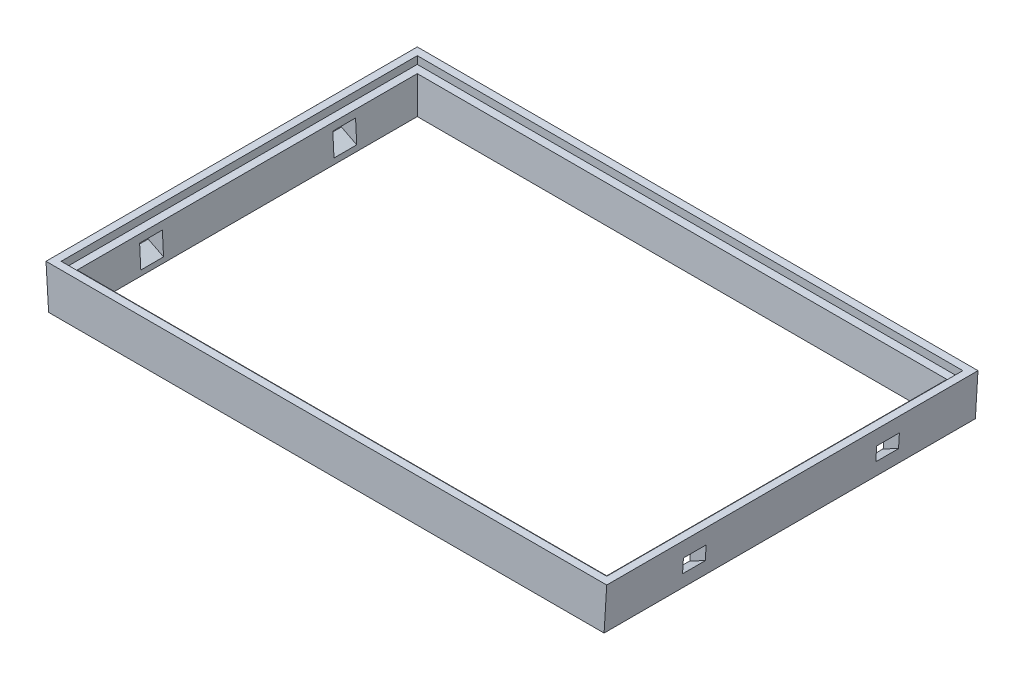
ISO-10303-21;
HEADER;
FILE_DESCRIPTION(('STEP AP214'),'2;1');
FILE_NAME('part.step','',(''),(''),'','','');
FILE_SCHEMA(('AUTOMOTIVE_DESIGN { 1 0 10303 214 1 1 1 1 }'));
ENDSEC;
DATA;
#1=APPLICATION_CONTEXT('core data for automotive mechanical design processes');
#2=APPLICATION_PROTOCOL_DEFINITION('international standard','automotive_design',2000,#1);
#3=PRODUCT_CONTEXT('',#1,'mechanical');
#4=PRODUCT('Part','Part','',(#3));
#5=PRODUCT_RELATED_PRODUCT_CATEGORY('part','',(#4));
#6=PRODUCT_DEFINITION_FORMATION('','',#4);
#7=PRODUCT_DEFINITION_CONTEXT('part definition',#1,'design');
#8=PRODUCT_DEFINITION('design','',#6,#7);
#9=PRODUCT_DEFINITION_SHAPE('','',#8);
#10=(LENGTH_UNIT() NAMED_UNIT(*) SI_UNIT(.MILLI.,.METRE.));
#11=(NAMED_UNIT(*) PLANE_ANGLE_UNIT() SI_UNIT($,.RADIAN.));
#12=(NAMED_UNIT(*) SI_UNIT($,.STERADIAN.) SOLID_ANGLE_UNIT());
#13=UNCERTAINTY_MEASURE_WITH_UNIT(LENGTH_MEASURE(1.E-05),#10,'distance_accuracy_value','');
#14=(GEOMETRIC_REPRESENTATION_CONTEXT(3) GLOBAL_UNCERTAINTY_ASSIGNED_CONTEXT((#13)) GLOBAL_UNIT_ASSIGNED_CONTEXT((#10,
#11,#12)) REPRESENTATION_CONTEXT('',''));
#15=CARTESIAN_POINT('',(0.,0.,0.));
#16=DIRECTION('',(0.,0.,1.));
#17=DIRECTION('',(1.,0.,0.));
#18=AXIS2_PLACEMENT_3D('',#15,#16,#17);
#19=CARTESIAN_POINT('',(87.2159938434906,-31.5566148727257,49.));
#20=DIRECTION('',(-0.998134798421867,0.0610485395348529,0.));
#21=DIRECTION('',(-0.0610485395348529,-0.998134798421867,0.));
#22=AXIS2_PLACEMENT_3D('',#19,#20,#21);
#23=PLANE('',#22);
#24=DIRECTION('',(0.,0.,1.));
#25=VECTOR('',#24,1.);
#26=CARTESIAN_POINT('',(90.4768218310422,21.7574514561684,7.93504103845607));
#27=LINE('',#26,#25);
#28=CARTESIAN_POINT('',(90.4768218310422,21.7574514561684,10.25));
#29=VERTEX_POINT('',#28);
#30=CARTESIAN_POINT('',(90.4768218310422,21.7574514561684,13.25));
#31=VERTEX_POINT('',#30);
#32=EDGE_CURVE('E360',#29,#31,#27,.T.);
#33=ORIENTED_EDGE('',*,*,#32,.T.);
#34=DIRECTION('',(-0.0610485395348529,-0.998134798421867,0.));
#35=VECTOR('',#34,1.);
#36=CARTESIAN_POINT('',(87.2159938434906,-31.5566148727257,13.25));
#37=LINE('',#36,#35);
#38=CARTESIAN_POINT('',(90.5907806278932,23.6206613149119,13.25));
#39=VERTEX_POINT('',#38);
#40=EDGE_CURVE('E429',#39,#31,#37,.T.);
#41=ORIENTED_EDGE('',*,*,#40,.F.);
#42=DIRECTION('',(0.,0.,1.));
#43=VECTOR('',#42,1.);
#44=CARTESIAN_POINT('',(90.5907806278932,23.6206613149119,49.));
#45=LINE('',#44,#43);
#46=CARTESIAN_POINT('',(90.5907806278932,23.6206613149119,10.25));
#47=VERTEX_POINT('',#46);
#48=EDGE_CURVE('E401',#47,#39,#45,.T.);
#49=ORIENTED_EDGE('',*,*,#48,.F.);
#50=DIRECTION('',(0.0610485395348529,0.998134798421867,0.));
#51=VECTOR('',#50,1.);
#52=CARTESIAN_POINT('',(87.2159938434906,-31.5566148727257,10.25));
#53=LINE('',#52,#51);
#54=EDGE_CURVE('E426',#29,#47,#53,.T.);
#55=ORIENTED_EDGE('',*,*,#54,.F.);
#56=EDGE_LOOP('',(#33,#41,#49,#55));
#57=FACE_BOUND('',#56,.T.);
#58=DIRECTION('',(0.0610485395348529,0.998134798421867,0.));
#59=VECTOR('',#58,1.);
#60=CARTESIAN_POINT('',(87.2159938434906,-31.5566148727257,35.75));
#61=LINE('',#60,#59);
#62=CARTESIAN_POINT('',(90.4734421965386,21.7021949204721,35.75));
#63=VERTEX_POINT('',#62);
#64=CARTESIAN_POINT('',(90.587418021541,23.5656831870309,35.75));
#65=VERTEX_POINT('',#64);
#66=EDGE_CURVE('E438',#63,#65,#61,.T.);
#67=ORIENTED_EDGE('',*,*,#66,.F.);
#68=DIRECTION('',(0.,0.,-1.));
#69=VECTOR('',#68,1.);
#70=CARTESIAN_POINT('',(90.4734421965386,21.7021949204721,41.0643892649192));
#71=LINE('',#70,#69);
#72=CARTESIAN_POINT('',(90.4734421965386,21.7021949204721,38.75));
#73=VERTEX_POINT('',#72);
#74=EDGE_CURVE('E375',#73,#63,#71,.T.);
#75=ORIENTED_EDGE('',*,*,#74,.F.);
#76=DIRECTION('',(-0.0610485395348529,-0.998134798421867,0.));
#77=VECTOR('',#76,1.);
#78=CARTESIAN_POINT('',(87.2159938434906,-31.5566148727257,38.75));
#79=LINE('',#78,#77);
#80=CARTESIAN_POINT('',(90.587418021541,23.565683187031,38.75));
#81=VERTEX_POINT('',#80);
#82=EDGE_CURVE('E432',#81,#73,#79,.T.);
#83=ORIENTED_EDGE('',*,*,#82,.F.);
#84=DIRECTION('',(0.,0.,1.));
#85=VECTOR('',#84,1.);
#86=CARTESIAN_POINT('',(90.587418021541,23.5656831870309,49.));
#87=LINE('',#86,#85);
#88=EDGE_CURVE('E435',#65,#81,#87,.T.);
#89=ORIENTED_EDGE('',*,*,#88,.F.);
#90=EDGE_LOOP('',(#67,#75,#83,#89));
#91=FACE_BOUND('',#90,.T.);
#92=DIRECTION('',(0.0610485395348529,0.998134798421867,0.));
#93=VECTOR('',#92,1.);
#94=CARTESIAN_POINT('',(87.2159938434906,-31.5566148727257,49.));
#95=LINE('',#94,#93);
#96=CARTESIAN_POINT('',(90.3693314951957,20.,49.));
#97=VERTEX_POINT('',#96);
#98=CARTESIAN_POINT('',(90.7159938434905,25.6678792936265,49.));
#99=VERTEX_POINT('',#98);
#100=EDGE_CURVE('E291',#97,#99,#95,.T.);
#101=ORIENTED_EDGE('',*,*,#100,.F.);
#102=DIRECTION('',(0.,0.,-1.));
#103=VECTOR('',#102,1.);
#104=CARTESIAN_POINT('',(90.3693314951957,20.,49.));
#105=LINE('',#104,#103);
#106=CARTESIAN_POINT('',(90.3693314951957,20.,0.));
#107=VERTEX_POINT('',#106);
#108=EDGE_CURVE('E350',#97,#107,#105,.T.);
#109=ORIENTED_EDGE('',*,*,#108,.T.);
#110=DIRECTION('',(0.0610485395348529,0.998134798421867,0.));
#111=VECTOR('',#110,1.);
#112=CARTESIAN_POINT('',(87.2159938434906,-31.5566148727257,0.));
#113=LINE('',#112,#111);
#114=CARTESIAN_POINT('',(90.7159938434905,25.6678792936265,0.));
#115=VERTEX_POINT('',#114);
#116=EDGE_CURVE('E287',#107,#115,#113,.T.);
#117=ORIENTED_EDGE('',*,*,#116,.T.);
#118=DIRECTION('',(0.,0.,-1.));
#119=VECTOR('',#118,1.);
#120=CARTESIAN_POINT('',(90.7159938434905,25.6678792936265,49.));
#121=LINE('',#120,#119);
#122=EDGE_CURVE('E294',#99,#115,#121,.T.);
#123=ORIENTED_EDGE('',*,*,#122,.F.);
#124=EDGE_LOOP('',(#101,#109,#117,#123));
#125=FACE_BOUND('',#124,.T.);
#126=ADVANCED_FACE('F69',(#57,#91,#125),#23,.F.);
#127=CARTESIAN_POINT('',(88.7159938434905,25.6678792936265,0.));
#128=DIRECTION('',(0.998629534754574,-0.0523359562429438,0.));
#129=DIRECTION('',(0.0523359562429438,0.998629534754574,0.));
#130=AXIS2_PLACEMENT_3D('',#127,#128,#129);
#131=PLANE('',#130);
#132=DIRECTION('',(-0.0523359562429442,-0.998629534754574,0.));
#133=VECTOR('',#132,1.);
#134=CARTESIAN_POINT('',(88.6141327079296,23.7242530428216,13.25));
#135=LINE('',#134,#133);
#136=CARTESIAN_POINT('',(88.6141327079296,23.7242530428216,13.25));
#137=VERTEX_POINT('',#136);
#138=CARTESIAN_POINT('',(88.4571248392008,20.7283644385579,13.25));
#139=VERTEX_POINT('',#138);
#140=EDGE_CURVE('E379',#137,#139,#135,.T.);
#141=ORIENTED_EDGE('',*,*,#140,.T.);
#142=DIRECTION('',(0.,0.,-1.));
#143=VECTOR('',#142,1.);
#144=CARTESIAN_POINT('',(88.4571248392008,20.7283644385579,13.25));
#145=LINE('',#144,#143);
#146=CARTESIAN_POINT('',(88.4571248392008,20.7283644385579,10.25));
#147=VERTEX_POINT('',#146);
#148=EDGE_CURVE('E415',#139,#147,#145,.T.);
#149=ORIENTED_EDGE('',*,*,#148,.T.);
#150=DIRECTION('',(0.0523359562429442,0.998629534754574,0.));
#151=VECTOR('',#150,1.);
#152=CARTESIAN_POINT('',(88.6141327079296,23.7242530428216,10.25));
#153=LINE('',#152,#151);
#154=CARTESIAN_POINT('',(88.6141327079296,23.7242530428216,10.25));
#155=VERTEX_POINT('',#154);
#156=EDGE_CURVE('E411',#147,#155,#153,.T.);
#157=ORIENTED_EDGE('',*,*,#156,.T.);
#158=DIRECTION('',(0.,0.,1.));
#159=VECTOR('',#158,1.);
#160=CARTESIAN_POINT('',(88.6141327079296,23.7242530428216,13.25));
#161=LINE('',#160,#159);
#162=EDGE_CURVE('E407',#155,#137,#161,.T.);
#163=ORIENTED_EDGE('',*,*,#162,.T.);
#164=EDGE_LOOP('',(#141,#149,#157,#163));
#165=FACE_BOUND('',#164,.T.);
#166=DIRECTION('',(0.0522644276887139,0.997264688634237,-0.052264427688714));
#167=VECTOR('',#166,1.);
#168=CARTESIAN_POINT('',(88.7214569842938,25.7721222300377,1.99453685919674));
#169=LINE('',#168,#167);
#170=CARTESIAN_POINT('',(88.4189528764672,20.,2.2970409670233));
#171=VERTEX_POINT('',#170);
#172=CARTESIAN_POINT('',(88.6635860642075,24.6678792936265,2.05240777928304));
#173=VERTEX_POINT('',#172);
#174=EDGE_CURVE('E273',#171,#173,#169,.T.);
#175=ORIENTED_EDGE('',*,*,#174,.F.);
#176=DIRECTION('',(0.,0.,1.));
#177=VECTOR('',#176,1.);
#178=CARTESIAN_POINT('',(88.4189528764672,20.,0.));
#179=LINE('',#178,#177);
#180=CARTESIAN_POINT('',(88.4189528764672,20.,46.7029590329767));
#181=VERTEX_POINT('',#180);
#182=EDGE_CURVE('E93',#171,#181,#179,.T.);
#183=ORIENTED_EDGE('',*,*,#182,.T.);
#184=DIRECTION('',(0.0522644276887139,0.997264688634237,0.052264427688714));
#185=VECTOR('',#184,1.);
#186=CARTESIAN_POINT('',(88.4736598605566,21.0438714411819,46.757666017066));
#187=LINE('',#186,#185);
#188=CARTESIAN_POINT('',(88.6635860642075,24.6678792936265,46.947592220717));
#189=VERTEX_POINT('',#188);
#190=EDGE_CURVE('E277',#181,#189,#187,.T.);
#191=ORIENTED_EDGE('',*,*,#190,.T.);
#192=DIRECTION('',(0.,0.,1.));
#193=VECTOR('',#192,1.);
#194=CARTESIAN_POINT('',(88.6635860642075,24.6678792936265,0.));
#195=LINE('',#194,#193);
#196=EDGE_CURVE('E78',#173,#189,#195,.T.);
#197=ORIENTED_EDGE('',*,*,#196,.F.);
#198=EDGE_LOOP('',(#175,#183,#191,#197));
#199=FACE_BOUND('',#198,.T.);
#200=DIRECTION('',(0.0523359562429442,0.998629534754574,0.));
#201=VECTOR('',#200,1.);
#202=CARTESIAN_POINT('',(88.6112501079645,23.6692497588719,35.75));
#203=LINE('',#202,#201);
#204=CARTESIAN_POINT('',(88.4542422392357,20.6733611546082,35.75));
#205=VERTEX_POINT('',#204);
#206=CARTESIAN_POINT('',(88.6112501079645,23.6692497588719,35.75));
#207=VERTEX_POINT('',#206);
#208=EDGE_CURVE('E380',#205,#207,#203,.T.);
#209=ORIENTED_EDGE('',*,*,#208,.T.);
#210=DIRECTION('',(0.,0.,1.));
#211=VECTOR('',#210,1.);
#212=CARTESIAN_POINT('',(88.6112501079645,23.6692497588719,35.75));
#213=LINE('',#212,#211);
#214=CARTESIAN_POINT('',(88.6112501079645,23.6692497588719,38.75));
#215=VERTEX_POINT('',#214);
#216=EDGE_CURVE('E393',#207,#215,#213,.T.);
#217=ORIENTED_EDGE('',*,*,#216,.T.);
#218=DIRECTION('',(-0.0523359562429442,-0.998629534754574,0.));
#219=VECTOR('',#218,1.);
#220=CARTESIAN_POINT('',(88.6112501079645,23.6692497588719,38.75));
#221=LINE('',#220,#219);
#222=CARTESIAN_POINT('',(88.4542422392357,20.6733611546082,38.75));
#223=VERTEX_POINT('',#222);
#224=EDGE_CURVE('E389',#215,#223,#221,.T.);
#225=ORIENTED_EDGE('',*,*,#224,.T.);
#226=DIRECTION('',(0.,0.,-1.));
#227=VECTOR('',#226,1.);
#228=CARTESIAN_POINT('',(88.4542422392357,20.6733611546082,35.75));
#229=LINE('',#228,#227);
#230=EDGE_CURVE('E384',#223,#205,#229,.T.);
#231=ORIENTED_EDGE('',*,*,#230,.T.);
#232=EDGE_LOOP('',(#209,#217,#225,#231));
#233=FACE_BOUND('',#232,.T.);
#234=ADVANCED_FACE('F338',(#165,#199,#233),#131,.F.);
#235=CARTESIAN_POINT('',(16.8205959095423,23.6195811303357,13.25));
#236=DIRECTION('',(0.,0.,1.));
#237=DIRECTION('',(1.,0.,0.));
#238=AXIS2_PLACEMENT_3D('',#235,#236,#237);
#239=PLANE('',#238);
#240=DIRECTION('',(0.891006524188368,-0.453990499739547,0.));
#241=VECTOR('',#240,1.);
#242=CARTESIAN_POINT('',(18.9748628477803,20.7283644385579,13.25));
#243=LINE('',#242,#241);
#244=CARTESIAN_POINT('',(16.9551658559388,21.7574514561684,13.25));
#245=VERTEX_POINT('',#244);
#246=CARTESIAN_POINT('',(18.9748628477803,20.7283644385579,13.25));
#247=VERTEX_POINT('',#246);
#248=EDGE_CURVE('E442',#245,#247,#243,.T.);
#249=ORIENTED_EDGE('',*,*,#248,.F.);
#250=DIRECTION('',(0.0610485395348535,-0.998134798421867,0.));
#251=VECTOR('',#250,1.);
#252=CARTESIAN_POINT('',(16.7159938434905,25.6678792936265,13.25));
#253=LINE('',#252,#251);
#254=CARTESIAN_POINT('',(16.8412070590879,23.6206613149119,13.25));
#255=VERTEX_POINT('',#254);
#256=EDGE_CURVE('E511',#255,#245,#253,.T.);
#257=ORIENTED_EDGE('',*,*,#256,.F.);
#258=DIRECTION('',(0.998629534754574,0.052335956242944,0.));
#259=VECTOR('',#258,1.);
#260=CARTESIAN_POINT('',(16.8205959095423,23.6195811303357,13.25));
#261=LINE('',#260,#259);
#262=CARTESIAN_POINT('',(18.8178549790515,23.7242530428216,13.25));
#263=VERTEX_POINT('',#262);
#264=EDGE_CURVE('E460',#255,#263,#261,.T.);
#265=ORIENTED_EDGE('',*,*,#264,.T.);
#266=DIRECTION('',(0.0523359562429442,-0.998629534754574,0.));
#267=VECTOR('',#266,1.);
#268=CARTESIAN_POINT('',(18.8178549790515,23.7242530428216,13.25));
#269=LINE('',#268,#267);
#270=EDGE_CURVE('E467',#263,#247,#269,.T.);
#271=ORIENTED_EDGE('',*,*,#270,.T.);
#272=EDGE_LOOP('',(#249,#257,#265,#271));
#273=FACE_BOUND('',#272,.T.);
#274=ADVANCED_FACE('F598',(#273),#239,.F.);
#275=CARTESIAN_POINT('',(16.8205959095423,23.6195811303357,10.25));
#276=DIRECTION('',(0.,0.,-1.));
#277=DIRECTION('',(0.,1.,0.));
#278=AXIS2_PLACEMENT_3D('',#275,#276,#277);
#279=PLANE('',#278);
#280=DIRECTION('',(0.891006524188368,-0.453990499739547,0.));
#281=VECTOR('',#280,1.);
#282=CARTESIAN_POINT('',(18.9748628477803,20.7283644385579,10.25));
#283=LINE('',#282,#281);
#284=CARTESIAN_POINT('',(16.9551658559388,21.7574514561684,10.25));
#285=VERTEX_POINT('',#284);
#286=CARTESIAN_POINT('',(18.9748628477803,20.7283644385579,10.25));
#287=VERTEX_POINT('',#286);
#288=EDGE_CURVE('E445',#285,#287,#283,.T.);
#289=ORIENTED_EDGE('',*,*,#288,.T.);
#290=DIRECTION('',(-0.0523359562429442,0.998629534754574,0.));
#291=VECTOR('',#290,1.);
#292=CARTESIAN_POINT('',(18.8178549790515,23.7242530428216,10.25));
#293=LINE('',#292,#291);
#294=CARTESIAN_POINT('',(18.8178549790515,23.7242530428216,10.25));
#295=VERTEX_POINT('',#294);
#296=EDGE_CURVE('E495',#287,#295,#293,.T.);
#297=ORIENTED_EDGE('',*,*,#296,.T.);
#298=DIRECTION('',(0.998629534754574,0.052335956242944,0.));
#299=VECTOR('',#298,1.);
#300=CARTESIAN_POINT('',(16.8205959095423,23.6195811303357,10.25));
#301=LINE('',#300,#299);
#302=CARTESIAN_POINT('',(16.8412070590879,23.6206613149119,10.25));
#303=VERTEX_POINT('',#302);
#304=EDGE_CURVE('E486',#303,#295,#301,.T.);
#305=ORIENTED_EDGE('',*,*,#304,.F.);
#306=DIRECTION('',(-0.0610485395348535,0.998134798421867,0.));
#307=VECTOR('',#306,1.);
#308=CARTESIAN_POINT('',(16.7159938434905,25.6678792936264,10.25));
#309=LINE('',#308,#307);
#310=EDGE_CURVE('E482',#285,#303,#309,.T.);
#311=ORIENTED_EDGE('',*,*,#310,.F.);
#312=EDGE_LOOP('',(#289,#297,#305,#311));
#313=FACE_BOUND('',#312,.T.);
#314=ADVANCED_FACE('F680',(#313),#279,.F.);
#315=CARTESIAN_POINT('',(16.8234785095074,23.564577846386,35.75));
#316=DIRECTION('',(0.,0.,-1.));
#317=DIRECTION('',(-1.,0.,0.));
#318=AXIS2_PLACEMENT_3D('',#315,#316,#317);
#319=PLANE('',#318);
#320=DIRECTION('',(-0.891006524188368,0.453990499739547,0.));
#321=VECTOR('',#320,1.);
#322=CARTESIAN_POINT('',(18.9777454477454,20.6733611546082,35.75));
#323=LINE('',#322,#321);
#324=CARTESIAN_POINT('',(18.9777454477454,20.6733611546082,35.75));
#325=VERTEX_POINT('',#324);
#326=CARTESIAN_POINT('',(16.9585454904425,21.7021949204721,35.75));
#327=VERTEX_POINT('',#326);
#328=EDGE_CURVE('E449',#325,#327,#323,.T.);
#329=ORIENTED_EDGE('',*,*,#328,.F.);
#330=DIRECTION('',(-0.0523359562429442,0.998629534754574,0.));
#331=VECTOR('',#330,1.);
#332=CARTESIAN_POINT('',(18.8207375790165,23.6692497588719,35.75));
#333=LINE('',#332,#331);
#334=CARTESIAN_POINT('',(18.8207375790165,23.6692497588719,35.75));
#335=VERTEX_POINT('',#334);
#336=EDGE_CURVE('E463',#325,#335,#333,.T.);
#337=ORIENTED_EDGE('',*,*,#336,.T.);
#338=DIRECTION('',(0.998629534754574,0.052335956242944,0.));
#339=VECTOR('',#338,1.);
#340=CARTESIAN_POINT('',(16.8234785095074,23.564577846386,35.75));
#341=LINE('',#340,#339);
#342=CARTESIAN_POINT('',(16.84456966544,23.5656831870309,35.75));
#343=VERTEX_POINT('',#342);
#344=EDGE_CURVE('E478',#343,#335,#341,.T.);
#345=ORIENTED_EDGE('',*,*,#344,.F.);
#346=DIRECTION('',(-0.0610485395348535,0.998134798421867,0.));
#347=VECTOR('',#346,1.);
#348=CARTESIAN_POINT('',(16.7159938434905,25.6678792936265,35.75));
#349=LINE('',#348,#347);
#350=EDGE_CURVE('E523',#327,#343,#349,.T.);
#351=ORIENTED_EDGE('',*,*,#350,.F.);
#352=EDGE_LOOP('',(#329,#337,#345,#351));
#353=FACE_BOUND('',#352,.T.);
#354=ADVANCED_FACE('F672',(#353),#319,.F.);
#355=CARTESIAN_POINT('',(16.8234785095074,23.564577846386,38.75));
#356=DIRECTION('',(0.,0.,1.));
#357=DIRECTION('',(1.,0.,0.));
#358=AXIS2_PLACEMENT_3D('',#355,#356,#357);
#359=PLANE('',#358);
#360=DIRECTION('',(-0.891006524188368,0.453990499739547,0.));
#361=VECTOR('',#360,1.);
#362=CARTESIAN_POINT('',(18.9777454477454,20.6733611546082,38.75));
#363=LINE('',#362,#361);
#364=CARTESIAN_POINT('',(18.9777454477454,20.6733611546082,38.75));
#365=VERTEX_POINT('',#364);
#366=CARTESIAN_POINT('',(16.9585454904425,21.7021949204721,38.75));
#367=VERTEX_POINT('',#366);
#368=EDGE_CURVE('E456',#365,#367,#363,.T.);
#369=ORIENTED_EDGE('',*,*,#368,.T.);
#370=DIRECTION('',(0.0610485395348535,-0.998134798421867,0.));
#371=VECTOR('',#370,1.);
#372=CARTESIAN_POINT('',(16.7159938434905,25.6678792936265,38.75));
#373=LINE('',#372,#371);
#374=CARTESIAN_POINT('',(16.84456966544,23.5656831870309,38.75));
#375=VERTEX_POINT('',#374);
#376=EDGE_CURVE('E519',#375,#367,#373,.T.);
#377=ORIENTED_EDGE('',*,*,#376,.F.);
#378=DIRECTION('',(0.998629534754574,0.052335956242944,0.));
#379=VECTOR('',#378,1.);
#380=CARTESIAN_POINT('',(16.8234785095074,23.564577846386,38.75));
#381=LINE('',#380,#379);
#382=CARTESIAN_POINT('',(18.8207375790165,23.6692497588719,38.75));
#383=VERTEX_POINT('',#382);
#384=EDGE_CURVE('E479',#375,#383,#381,.T.);
#385=ORIENTED_EDGE('',*,*,#384,.T.);
#386=DIRECTION('',(0.0523359562429442,-0.998629534754574,0.));
#387=VECTOR('',#386,1.);
#388=CARTESIAN_POINT('',(18.8207375790165,23.6692497588719,38.75));
#389=LINE('',#388,#387);
#390=EDGE_CURVE('E471',#383,#365,#389,.T.);
#391=ORIENTED_EDGE('',*,*,#390,.T.);
#392=EDGE_LOOP('',(#369,#377,#385,#391));
#393=FACE_BOUND('',#392,.T.);
#394=ADVANCED_FACE('F612',(#393),#359,.F.);
#395=CARTESIAN_POINT('',(90.7159938434905,25.6678792936265,49.));
#396=DIRECTION('',(0.,-1.,0.));
#397=DIRECTION('',(1.,0.,0.));
#398=AXIS2_PLACEMENT_3D('',#395,#396,#397);
#399=PLANE('',#398);
#400=DIRECTION('',(1.,0.,0.));
#401=VECTOR('',#400,1.);
#402=CARTESIAN_POINT('',(17.7159938434905,25.6678792936265,48.));
#403=LINE('',#402,#401);
#404=CARTESIAN_POINT('',(17.7159938434905,25.6678792936265,48.));
#405=VERTEX_POINT('',#404);
#406=CARTESIAN_POINT('',(89.7159938434905,25.6678792936265,48.));
#407=VERTEX_POINT('',#406);
#408=EDGE_CURVE('E546',#405,#407,#403,.T.);
#409=ORIENTED_EDGE('',*,*,#408,.F.);
#410=DIRECTION('',(0.,0.,1.));
#411=VECTOR('',#410,1.);
#412=CARTESIAN_POINT('',(17.7159938434905,25.6678792936265,1.));
#413=LINE('',#412,#411);
#414=CARTESIAN_POINT('',(17.7159938434905,25.6678792936265,1.));
#415=VERTEX_POINT('',#414);
#416=EDGE_CURVE('E526',#415,#405,#413,.T.);
#417=ORIENTED_EDGE('',*,*,#416,.F.);
#418=DIRECTION('',(-1.,0.,0.));
#419=VECTOR('',#418,1.);
#420=CARTESIAN_POINT('',(17.7159938434905,25.6678792936265,1.));
#421=LINE('',#420,#419);
#422=CARTESIAN_POINT('',(89.7159938434905,25.6678792936265,1.));
#423=VERTEX_POINT('',#422);
#424=EDGE_CURVE('E532',#423,#415,#421,.T.);
#425=ORIENTED_EDGE('',*,*,#424,.F.);
#426=DIRECTION('',(0.,0.,-1.));
#427=VECTOR('',#426,1.);
#428=CARTESIAN_POINT('',(89.7159938434905,25.6678792936265,1.));
#429=LINE('',#428,#427);
#430=EDGE_CURVE('E550',#407,#423,#429,.T.);
#431=ORIENTED_EDGE('',*,*,#430,.F.);
#432=EDGE_LOOP('',(#409,#417,#425,#431));
#433=FACE_BOUND('',#432,.T.);
#434=DIRECTION('',(-1.,0.,0.));
#435=VECTOR('',#434,1.);
#436=CARTESIAN_POINT('',(90.7159938434905,25.6678792936265,0.));
#437=LINE('',#436,#435);
#438=CARTESIAN_POINT('',(16.7159938434905,25.6678792936265,0.));
#439=VERTEX_POINT('',#438);
#440=EDGE_CURVE('E295',#115,#439,#437,.T.);
#441=ORIENTED_EDGE('',*,*,#440,.T.);
#442=DIRECTION('',(0.,0.,-1.));
#443=VECTOR('',#442,1.);
#444=CARTESIAN_POINT('',(16.7159938434905,25.6678792936265,49.));
#445=LINE('',#444,#443);
#446=CARTESIAN_POINT('',(16.7159938434905,25.6678792936265,49.));
#447=VERTEX_POINT('',#446);
#448=EDGE_CURVE('E308',#447,#439,#445,.T.);
#449=ORIENTED_EDGE('',*,*,#448,.F.);
#450=DIRECTION('',(-1.,0.,0.));
#451=VECTOR('',#450,1.);
#452=CARTESIAN_POINT('',(90.7159938434905,25.6678792936265,49.));
#453=LINE('',#452,#451);
#454=EDGE_CURVE('E282',#99,#447,#453,.T.);
#455=ORIENTED_EDGE('',*,*,#454,.F.);
#456=ORIENTED_EDGE('',*,*,#122,.T.);
#457=EDGE_LOOP('',(#441,#449,#455,#456));
#458=FACE_BOUND('',#457,.T.);
#459=ADVANCED_FACE('F71',(#433,#458),#399,.F.);
#460=CARTESIAN_POINT('',(16.7159938434905,25.6678792936265,49.));
#461=DIRECTION('',(0.998134798421867,0.0610485395348536,0.));
#462=DIRECTION('',(-0.0610485395348535,0.998134798421867,0.));
#463=AXIS2_PLACEMENT_3D('',#460,#461,#462);
#464=PLANE('',#463);
#465=ORIENTED_EDGE('',*,*,#256,.T.);
#466=DIRECTION('',(0.,0.,1.));
#467=VECTOR('',#466,1.);
#468=CARTESIAN_POINT('',(16.9551658559388,21.7574514561684,7.93504103845608));
#469=LINE('',#468,#467);
#470=EDGE_CURVE('E441',#285,#245,#469,.T.);
#471=ORIENTED_EDGE('',*,*,#470,.F.);
#472=ORIENTED_EDGE('',*,*,#310,.T.);
#473=DIRECTION('',(0.,0.,1.));
#474=VECTOR('',#473,1.);
#475=CARTESIAN_POINT('',(16.8412070590879,23.6206613149119,49.));
#476=LINE('',#475,#474);
#477=EDGE_CURVE('E507',#303,#255,#476,.T.);
#478=ORIENTED_EDGE('',*,*,#477,.T.);
#479=EDGE_LOOP('',(#465,#471,#472,#478));
#480=FACE_BOUND('',#479,.T.);
#481=DIRECTION('',(0.,0.,-1.));
#482=VECTOR('',#481,1.);
#483=CARTESIAN_POINT('',(16.9585454904425,21.7021949204721,41.0643892649192));
#484=LINE('',#483,#482);
#485=EDGE_CURVE('E455',#367,#327,#484,.T.);
#486=ORIENTED_EDGE('',*,*,#485,.T.);
#487=ORIENTED_EDGE('',*,*,#350,.T.);
#488=DIRECTION('',(0.,0.,1.));
#489=VECTOR('',#488,1.);
#490=CARTESIAN_POINT('',(16.84456966544,23.5656831870309,49.));
#491=LINE('',#490,#489);
#492=EDGE_CURVE('E515',#343,#375,#491,.T.);
#493=ORIENTED_EDGE('',*,*,#492,.T.);
#494=ORIENTED_EDGE('',*,*,#376,.T.);
#495=EDGE_LOOP('',(#486,#487,#493,#494));
#496=FACE_BOUND('',#495,.T.);
#497=DIRECTION('',(0.0610485395348535,-0.998134798421867,0.));
#498=VECTOR('',#497,1.);
#499=CARTESIAN_POINT('',(16.7159938434905,25.6678792936265,0.));
#500=LINE('',#499,#498);
#501=CARTESIAN_POINT('',(17.0626561917854,20.,0.));
#502=VERTEX_POINT('',#501);
#503=EDGE_CURVE('E299',#439,#502,#500,.T.);
#504=ORIENTED_EDGE('',*,*,#503,.T.);
#505=DIRECTION('',(0.,0.,1.));
#506=VECTOR('',#505,1.);
#507=CARTESIAN_POINT('',(17.0626561917854,20.,49.));
#508=LINE('',#507,#506);
#509=CARTESIAN_POINT('',(17.0626561917854,20.,49.));
#510=VERTEX_POINT('',#509);
#511=EDGE_CURVE('E85',#502,#510,#508,.T.);
#512=ORIENTED_EDGE('',*,*,#511,.T.);
#513=DIRECTION('',(0.0610485395348535,-0.998134798421867,0.));
#514=VECTOR('',#513,1.);
#515=CARTESIAN_POINT('',(16.7159938434905,25.6678792936265,49.));
#516=LINE('',#515,#514);
#517=EDGE_CURVE('E286',#447,#510,#516,.T.);
#518=ORIENTED_EDGE('',*,*,#517,.F.);
#519=ORIENTED_EDGE('',*,*,#448,.T.);
#520=EDGE_LOOP('',(#504,#512,#518,#519));
#521=FACE_BOUND('',#520,.T.);
#522=ADVANCED_FACE('F603',(#480,#496,#521),#464,.F.);
#523=CARTESIAN_POINT('',(0.,0.,49.));
#524=DIRECTION('',(0.,0.,1.));
#525=DIRECTION('',(1.,0.,0.));
#526=AXIS2_PLACEMENT_3D('',#523,#524,#525);
#527=PLANE('',#526);
#528=DIRECTION('',(-1.,0.,0.));
#529=VECTOR('',#528,1.);
#530=CARTESIAN_POINT('',(0.,20.,49.));
#531=LINE('',#530,#529);
#532=EDGE_CURVE('E354',#97,#510,#531,.T.);
#533=ORIENTED_EDGE('',*,*,#532,.F.);
#534=ORIENTED_EDGE('',*,*,#100,.T.);
#535=ORIENTED_EDGE('',*,*,#454,.T.);
#536=ORIENTED_EDGE('',*,*,#517,.T.);
#537=EDGE_LOOP('',(#533,#534,#535,#536));
#538=FACE_BOUND('',#537,.T.);
#539=ADVANCED_FACE('F605',(#538),#527,.T.);
#540=CARTESIAN_POINT('',(0.,0.,0.));
#541=DIRECTION('',(0.,0.,1.));
#542=DIRECTION('',(1.,0.,0.));
#543=AXIS2_PLACEMENT_3D('',#540,#541,#542);
#544=PLANE('',#543);
#545=ORIENTED_EDGE('',*,*,#116,.F.);
#546=DIRECTION('',(-1.,0.,0.));
#547=VECTOR('',#546,1.);
#548=CARTESIAN_POINT('',(0.,20.,0.));
#549=LINE('',#548,#547);
#550=EDGE_CURVE('E341',#107,#502,#549,.T.);
#551=ORIENTED_EDGE('',*,*,#550,.T.);
#552=ORIENTED_EDGE('',*,*,#503,.F.);
#553=ORIENTED_EDGE('',*,*,#440,.F.);
#554=EDGE_LOOP('',(#545,#551,#552,#553));
#555=FACE_BOUND('',#554,.T.);
#556=ADVANCED_FACE('F588',(#555),#544,.F.);
#557=CARTESIAN_POINT('',(0.,24.6678792936265,0.));
#558=DIRECTION('',(0.,1.,0.));
#559=DIRECTION('',(-1.,0.,0.));
#560=AXIS2_PLACEMENT_3D('',#557,#558,#559);
#561=PLANE('',#560);
#562=DIRECTION('',(0.,0.,1.));
#563=VECTOR('',#562,1.);
#564=CARTESIAN_POINT('',(17.7159938434905,24.6678792936265,1.));
#565=LINE('',#564,#563);
#566=CARTESIAN_POINT('',(17.7159938434905,24.6678792936265,1.));
#567=VERTEX_POINT('',#566);
#568=CARTESIAN_POINT('',(17.7159938434905,24.6678792936265,48.));
#569=VERTEX_POINT('',#568);
#570=EDGE_CURVE('E527',#567,#569,#565,.T.);
#571=ORIENTED_EDGE('',*,*,#570,.T.);
#572=DIRECTION('',(1.,0.,0.));
#573=VECTOR('',#572,1.);
#574=CARTESIAN_POINT('',(17.7159938434905,24.6678792936265,48.));
#575=LINE('',#574,#573);
#576=CARTESIAN_POINT('',(89.7159938434905,24.6678792936265,48.));
#577=VERTEX_POINT('',#576);
#578=EDGE_CURVE('E531',#569,#577,#575,.T.);
#579=ORIENTED_EDGE('',*,*,#578,.T.);
#580=DIRECTION('',(0.,0.,-1.));
#581=VECTOR('',#580,1.);
#582=CARTESIAN_POINT('',(89.7159938434905,24.6678792936265,1.));
#583=LINE('',#582,#581);
#584=CARTESIAN_POINT('',(89.7159938434905,24.6678792936265,1.));
#585=VERTEX_POINT('',#584);
#586=EDGE_CURVE('E536',#577,#585,#583,.T.);
#587=ORIENTED_EDGE('',*,*,#586,.T.);
#588=DIRECTION('',(-1.,0.,0.));
#589=VECTOR('',#588,1.);
#590=CARTESIAN_POINT('',(17.7159938434905,24.6678792936265,1.));
#591=LINE('',#590,#589);
#592=EDGE_CURVE('E540',#585,#567,#591,.T.);
#593=ORIENTED_EDGE('',*,*,#592,.T.);
#594=EDGE_LOOP('',(#571,#579,#587,#593));
#595=FACE_BOUND('',#594,.T.);
#596=DIRECTION('',(1.,0.,0.));
#597=VECTOR('',#596,1.);
#598=CARTESIAN_POINT('',(0.,24.6678792936265,2.05240777928305));
#599=LINE('',#598,#597);
#600=CARTESIAN_POINT('',(18.7684016227736,24.6678792936265,2.05240777928305));
#601=VERTEX_POINT('',#600);
#602=EDGE_CURVE('E271',#601,#173,#599,.T.);
#603=ORIENTED_EDGE('',*,*,#602,.T.);
#604=ORIENTED_EDGE('',*,*,#196,.T.);
#605=DIRECTION('',(-1.,0.,0.));
#606=VECTOR('',#605,1.);
#607=CARTESIAN_POINT('',(0.,24.6678792936265,46.947592220717));
#608=LINE('',#607,#606);
#609=CARTESIAN_POINT('',(18.7684016227736,24.6678792936265,46.947592220717));
#610=VERTEX_POINT('',#609);
#611=EDGE_CURVE('E318',#189,#610,#608,.T.);
#612=ORIENTED_EDGE('',*,*,#611,.T.);
#613=DIRECTION('',(0.,0.,-1.));
#614=VECTOR('',#613,1.);
#615=CARTESIAN_POINT('',(18.7684016227736,24.6678792936265,0.));
#616=LINE('',#615,#614);
#617=EDGE_CURVE('E324',#610,#601,#616,.T.);
#618=ORIENTED_EDGE('',*,*,#617,.T.);
#619=EDGE_LOOP('',(#603,#604,#612,#618));
#620=FACE_BOUND('',#619,.T.);
#621=ADVANCED_FACE('F317',(#595,#620),#561,.T.);
#622=CARTESIAN_POINT('',(17.7159938434905,24.6678792936265,1.));
#623=DIRECTION('',(-1.,0.,0.));
#624=DIRECTION('',(0.,-1.,0.));
#625=AXIS2_PLACEMENT_3D('',#622,#623,#624);
#626=PLANE('',#625);
#627=ORIENTED_EDGE('',*,*,#416,.T.);
#628=DIRECTION('',(0.,1.,0.));
#629=VECTOR('',#628,1.);
#630=CARTESIAN_POINT('',(17.7159938434905,24.6678792936265,48.));
#631=LINE('',#630,#629);
#632=EDGE_CURVE('E333',#569,#405,#631,.T.);
#633=ORIENTED_EDGE('',*,*,#632,.F.);
#634=ORIENTED_EDGE('',*,*,#570,.F.);
#635=DIRECTION('',(0.,1.,0.));
#636=VECTOR('',#635,1.);
#637=CARTESIAN_POINT('',(17.7159938434905,24.6678792936265,1.));
#638=LINE('',#637,#636);
#639=EDGE_CURVE('E325',#567,#415,#638,.T.);
#640=ORIENTED_EDGE('',*,*,#639,.T.);
#641=EDGE_LOOP('',(#627,#633,#634,#640));
#642=FACE_BOUND('',#641,.T.);
#643=ADVANCED_FACE('F580',(#642),#626,.F.);
#644=CARTESIAN_POINT('',(17.7159938434905,24.6678792936265,1.));
#645=DIRECTION('',(0.,0.,-1.));
#646=DIRECTION('',(-1.,0.,0.));
#647=AXIS2_PLACEMENT_3D('',#644,#645,#646);
#648=PLANE('',#647);
#649=ORIENTED_EDGE('',*,*,#424,.T.);
#650=ORIENTED_EDGE('',*,*,#639,.F.);
#651=ORIENTED_EDGE('',*,*,#592,.F.);
#652=DIRECTION('',(0.,1.,0.));
#653=VECTOR('',#652,1.);
#654=CARTESIAN_POINT('',(89.7159938434905,24.6678792936265,1.));
#655=LINE('',#654,#653);
#656=EDGE_CURVE('E330',#585,#423,#655,.T.);
#657=ORIENTED_EDGE('',*,*,#656,.T.);
#658=EDGE_LOOP('',(#649,#650,#651,#657));
#659=FACE_BOUND('',#658,.T.);
#660=ADVANCED_FACE('F579',(#659),#648,.F.);
#661=CARTESIAN_POINT('',(89.7159938434905,24.6678792936265,1.));
#662=DIRECTION('',(1.,0.,0.));
#663=DIRECTION('',(0.,1.,0.));
#664=AXIS2_PLACEMENT_3D('',#661,#662,#663);
#665=PLANE('',#664);
#666=ORIENTED_EDGE('',*,*,#430,.T.);
#667=ORIENTED_EDGE('',*,*,#656,.F.);
#668=ORIENTED_EDGE('',*,*,#586,.F.);
#669=DIRECTION('',(0.,1.,0.));
#670=VECTOR('',#669,1.);
#671=CARTESIAN_POINT('',(89.7159938434905,24.6678792936265,48.));
#672=LINE('',#671,#670);
#673=EDGE_CURVE('E558',#577,#407,#672,.T.);
#674=ORIENTED_EDGE('',*,*,#673,.T.);
#675=EDGE_LOOP('',(#666,#667,#668,#674));
#676=FACE_BOUND('',#675,.T.);
#677=ADVANCED_FACE('F575',(#676),#665,.F.);
#678=CARTESIAN_POINT('',(17.7159938434905,24.6678792936265,48.));
#679=DIRECTION('',(0.,0.,1.));
#680=DIRECTION('',(1.,0.,0.));
#681=AXIS2_PLACEMENT_3D('',#678,#679,#680);
#682=PLANE('',#681);
#683=ORIENTED_EDGE('',*,*,#408,.T.);
#684=ORIENTED_EDGE('',*,*,#673,.F.);
#685=ORIENTED_EDGE('',*,*,#578,.F.);
#686=ORIENTED_EDGE('',*,*,#632,.T.);
#687=EDGE_LOOP('',(#683,#684,#685,#686));
#688=FACE_BOUND('',#687,.T.);
#689=ADVANCED_FACE('F567',(#688),#682,.F.);
#690=CARTESIAN_POINT('',(0.,25.6678792936265,47.));
#691=DIRECTION('',(0.,-0.0523359562429439,0.998629534754574));
#692=DIRECTION('',(0.,-0.998629534754574,-0.0523359562429439));
#693=AXIS2_PLACEMENT_3D('',#690,#691,#692);
#694=PLANE('',#693);
#695=ORIENTED_EDGE('',*,*,#190,.F.);
#696=DIRECTION('',(-1.,0.,0.));
#697=VECTOR('',#696,1.);
#698=CARTESIAN_POINT('',(0.,20.,46.7029590329767));
#699=LINE('',#698,#697);
#700=CARTESIAN_POINT('',(19.0130348105138,20.,46.7029590329767));
#701=VERTEX_POINT('',#700);
#702=EDGE_CURVE('E266',#181,#701,#699,.T.);
#703=ORIENTED_EDGE('',*,*,#702,.T.);
#704=DIRECTION('',(-0.0522644276887141,0.997264688634237,0.052264427688714));
#705=VECTOR('',#704,1.);
#706=CARTESIAN_POINT('',(18.8443776523671,23.2181702879618,46.8716161911234));
#707=LINE('',#706,#705);
#708=EDGE_CURVE('E264',#701,#610,#707,.T.);
#709=ORIENTED_EDGE('',*,*,#708,.T.);
#710=ORIENTED_EDGE('',*,*,#611,.F.);
#711=EDGE_LOOP('',(#695,#703,#709,#710));
#712=FACE_BOUND('',#711,.T.);
#713=ADVANCED_FACE('F322',(#712),#694,.F.);
#714=CARTESIAN_POINT('',(18.7159938434905,25.6678792936265,0.));
#715=DIRECTION('',(-0.998629534754574,-0.052335956242944,0.));
#716=DIRECTION('',(0.052335956242944,-0.998629534754574,0.));
#717=AXIS2_PLACEMENT_3D('',#714,#715,#716);
#718=PLANE('',#717);
#719=DIRECTION('',(0.,0.,1.));
#720=VECTOR('',#719,1.);
#721=CARTESIAN_POINT('',(18.8207375790165,23.6692497588719,35.75));
#722=LINE('',#721,#720);
#723=EDGE_CURVE('E466',#335,#383,#722,.T.);
#724=ORIENTED_EDGE('',*,*,#723,.F.);
#725=ORIENTED_EDGE('',*,*,#336,.F.);
#726=DIRECTION('',(0.,0.,-1.));
#727=VECTOR('',#726,1.);
#728=CARTESIAN_POINT('',(18.9777454477454,20.6733611546082,35.75));
#729=LINE('',#728,#727);
#730=EDGE_CURVE('E475',#365,#325,#729,.T.);
#731=ORIENTED_EDGE('',*,*,#730,.F.);
#732=ORIENTED_EDGE('',*,*,#390,.F.);
#733=EDGE_LOOP('',(#724,#725,#731,#732));
#734=FACE_BOUND('',#733,.T.);
#735=DIRECTION('',(0.,0.,-1.));
#736=VECTOR('',#735,1.);
#737=CARTESIAN_POINT('',(18.9748628477803,20.7283644385579,13.25));
#738=LINE('',#737,#736);
#739=EDGE_CURVE('E499',#247,#287,#738,.T.);
#740=ORIENTED_EDGE('',*,*,#739,.F.);
#741=ORIENTED_EDGE('',*,*,#270,.F.);
#742=DIRECTION('',(0.,0.,1.));
#743=VECTOR('',#742,1.);
#744=CARTESIAN_POINT('',(18.8178549790515,23.7242530428216,13.25));
#745=LINE('',#744,#743);
#746=EDGE_CURVE('E489',#295,#263,#745,.T.);
#747=ORIENTED_EDGE('',*,*,#746,.F.);
#748=ORIENTED_EDGE('',*,*,#296,.F.);
#749=EDGE_LOOP('',(#740,#741,#747,#748));
#750=FACE_BOUND('',#749,.T.);
#751=ORIENTED_EDGE('',*,*,#708,.F.);
#752=DIRECTION('',(0.,0.,-1.));
#753=VECTOR('',#752,1.);
#754=CARTESIAN_POINT('',(19.0130348105138,20.,0.));
#755=LINE('',#754,#753);
#756=CARTESIAN_POINT('',(19.0130348105138,20.,2.2970409670233));
#757=VERTEX_POINT('',#756);
#758=EDGE_CURVE('E253',#701,#757,#755,.T.);
#759=ORIENTED_EDGE('',*,*,#758,.T.);
#760=DIRECTION('',(-0.0522644276887141,0.997264688634237,-0.052264427688714));
#761=VECTOR('',#760,1.);
#762=CARTESIAN_POINT('',(18.6648697886706,26.6433843716767,1.94887594518006));
#763=LINE('',#762,#761);
#764=EDGE_CURVE('E262',#757,#601,#763,.T.);
#765=ORIENTED_EDGE('',*,*,#764,.T.);
#766=ORIENTED_EDGE('',*,*,#617,.F.);
#767=EDGE_LOOP('',(#751,#759,#765,#766));
#768=FACE_BOUND('',#767,.T.);
#769=ADVANCED_FACE('F260',(#734,#750,#768),#718,.F.);
#770=CARTESIAN_POINT('',(0.,25.6678792936265,2.00000000000001));
#771=DIRECTION('',(0.,-0.0523359562429439,-0.998629534754574));
#772=DIRECTION('',(0.,0.998629534754574,-0.0523359562429439));
#773=AXIS2_PLACEMENT_3D('',#770,#771,#772);
#774=PLANE('',#773);
#775=ORIENTED_EDGE('',*,*,#764,.F.);
#776=DIRECTION('',(1.,0.,0.));
#777=VECTOR('',#776,1.);
#778=CARTESIAN_POINT('',(0.,20.,2.29704096702331));
#779=LINE('',#778,#777);
#780=EDGE_CURVE('E13',#757,#171,#779,.T.);
#781=ORIENTED_EDGE('',*,*,#780,.T.);
#782=ORIENTED_EDGE('',*,*,#174,.T.);
#783=ORIENTED_EDGE('',*,*,#602,.F.);
#784=EDGE_LOOP('',(#775,#781,#782,#783));
#785=FACE_BOUND('',#784,.T.);
#786=ADVANCED_FACE('F269',(#785),#774,.F.);
#787=CARTESIAN_POINT('',(16.8205959095423,23.6195811303357,13.25));
#788=DIRECTION('',(-0.052335956242944,0.998629534754574,0.));
#789=DIRECTION('',(-0.998629534754574,-0.052335956242944,0.));
#790=AXIS2_PLACEMENT_3D('',#787,#788,#789);
#791=PLANE('',#790);
#792=ORIENTED_EDGE('',*,*,#304,.T.);
#793=ORIENTED_EDGE('',*,*,#746,.T.);
#794=ORIENTED_EDGE('',*,*,#264,.F.);
#795=ORIENTED_EDGE('',*,*,#477,.F.);
#796=EDGE_LOOP('',(#792,#793,#794,#795));
#797=FACE_BOUND('',#796,.T.);
#798=ADVANCED_FACE('F676',(#797),#791,.F.);
#799=CARTESIAN_POINT('',(16.8234785095074,23.564577846386,35.75));
#800=DIRECTION('',(-0.052335956242944,0.998629534754574,0.));
#801=DIRECTION('',(-0.998629534754574,-0.052335956242944,0.));
#802=AXIS2_PLACEMENT_3D('',#799,#800,#801);
#803=PLANE('',#802);
#804=ORIENTED_EDGE('',*,*,#344,.T.);
#805=ORIENTED_EDGE('',*,*,#723,.T.);
#806=ORIENTED_EDGE('',*,*,#384,.F.);
#807=ORIENTED_EDGE('',*,*,#492,.F.);
#808=EDGE_LOOP('',(#804,#805,#806,#807));
#809=FACE_BOUND('',#808,.T.);
#810=ADVANCED_FACE('F668',(#809),#803,.F.);
#811=CARTESIAN_POINT('',(18.9777454477454,20.6733611546082,41.0643892649192));
#812=DIRECTION('',(-0.453990499739547,-0.891006524188368,0.));
#813=DIRECTION('',(0.891006524188368,-0.453990499739547,0.));
#814=AXIS2_PLACEMENT_3D('',#811,#812,#813);
#815=PLANE('',#814);
#816=ORIENTED_EDGE('',*,*,#368,.F.);
#817=ORIENTED_EDGE('',*,*,#730,.T.);
#818=ORIENTED_EDGE('',*,*,#328,.T.);
#819=ORIENTED_EDGE('',*,*,#485,.F.);
#820=EDGE_LOOP('',(#816,#817,#818,#819));
#821=FACE_BOUND('',#820,.T.);
#822=ADVANCED_FACE('F664',(#821),#815,.F.);
#823=CARTESIAN_POINT('',(18.9748628477803,20.7283644385579,7.93504103845608));
#824=DIRECTION('',(-0.453990499739547,-0.891006524188368,0.));
#825=DIRECTION('',(0.891006524188368,-0.453990499739547,0.));
#826=AXIS2_PLACEMENT_3D('',#823,#824,#825);
#827=PLANE('',#826);
#828=ORIENTED_EDGE('',*,*,#288,.F.);
#829=ORIENTED_EDGE('',*,*,#470,.T.);
#830=ORIENTED_EDGE('',*,*,#248,.T.);
#831=ORIENTED_EDGE('',*,*,#739,.T.);
#832=EDGE_LOOP('',(#828,#829,#830,#831));
#833=FACE_BOUND('',#832,.T.);
#834=ADVANCED_FACE('F660',(#833),#827,.F.);
#835=CARTESIAN_POINT('',(90.6113917774388,23.6195811303357,13.25));
#836=DIRECTION('',(0.,0.,-1.));
#837=DIRECTION('',(-1.,0.,0.));
#838=AXIS2_PLACEMENT_3D('',#835,#836,#837);
#839=PLANE('',#838);
#840=DIRECTION('',(-0.891006524188368,-0.453990499739547,0.));
#841=VECTOR('',#840,1.);
#842=CARTESIAN_POINT('',(88.4571248392008,20.7283644385579,13.25));
#843=LINE('',#842,#841);
#844=EDGE_CURVE('E357',#31,#139,#843,.T.);
#845=ORIENTED_EDGE('',*,*,#844,.T.);
#846=ORIENTED_EDGE('',*,*,#140,.F.);
#847=DIRECTION('',(-0.998629534754574,0.052335956242944,0.));
#848=VECTOR('',#847,1.);
#849=CARTESIAN_POINT('',(90.6113917774388,23.6195811303357,13.25));
#850=LINE('',#849,#848);
#851=EDGE_CURVE('E418',#39,#137,#850,.T.);
#852=ORIENTED_EDGE('',*,*,#851,.F.);
#853=ORIENTED_EDGE('',*,*,#40,.T.);
#854=EDGE_LOOP('',(#845,#846,#852,#853));
#855=FACE_BOUND('',#854,.T.);
#856=ADVANCED_FACE('F653',(#855),#839,.T.);
#857=CARTESIAN_POINT('',(90.6113917774388,23.6195811303357,10.25));
#858=DIRECTION('',(0.,0.,1.));
#859=DIRECTION('',(0.,-1.,0.));
#860=AXIS2_PLACEMENT_3D('',#857,#858,#859);
#861=PLANE('',#860);
#862=DIRECTION('',(-0.891006524188368,-0.453990499739547,0.));
#863=VECTOR('',#862,1.);
#864=CARTESIAN_POINT('',(88.4571248392008,20.7283644385579,10.25));
#865=LINE('',#864,#863);
#866=EDGE_CURVE('E361',#29,#147,#865,.T.);
#867=ORIENTED_EDGE('',*,*,#866,.F.);
#868=ORIENTED_EDGE('',*,*,#54,.T.);
#869=DIRECTION('',(-0.998629534754574,0.052335956242944,0.));
#870=VECTOR('',#869,1.);
#871=CARTESIAN_POINT('',(90.6113917774388,23.6195811303357,10.25));
#872=LINE('',#871,#870);
#873=EDGE_CURVE('E385',#47,#155,#872,.T.);
#874=ORIENTED_EDGE('',*,*,#873,.T.);
#875=ORIENTED_EDGE('',*,*,#156,.F.);
#876=EDGE_LOOP('',(#867,#868,#874,#875));
#877=FACE_BOUND('',#876,.T.);
#878=ADVANCED_FACE('F650',(#877),#861,.T.);
#879=CARTESIAN_POINT('',(90.6113917774388,23.6195811303357,13.25));
#880=DIRECTION('',(-0.052335956242944,-0.998629534754574,0.));
#881=DIRECTION('',(0.998629534754574,-0.052335956242944,0.));
#882=AXIS2_PLACEMENT_3D('',#879,#880,#881);
#883=PLANE('',#882);
#884=ORIENTED_EDGE('',*,*,#48,.T.);
#885=ORIENTED_EDGE('',*,*,#851,.T.);
#886=ORIENTED_EDGE('',*,*,#162,.F.);
#887=ORIENTED_EDGE('',*,*,#873,.F.);
#888=EDGE_LOOP('',(#884,#885,#886,#887));
#889=FACE_BOUND('',#888,.T.);
#890=ADVANCED_FACE('F648',(#889),#883,.T.);
#891=CARTESIAN_POINT('',(90.6085091774737,23.564577846386,35.75));
#892=DIRECTION('',(0.,0.,1.));
#893=DIRECTION('',(1.,0.,0.));
#894=AXIS2_PLACEMENT_3D('',#891,#892,#893);
#895=PLANE('',#894);
#896=DIRECTION('',(0.891006524188368,0.453990499739547,0.));
#897=VECTOR('',#896,1.);
#898=CARTESIAN_POINT('',(88.4542422392357,20.6733611546082,35.75));
#899=LINE('',#898,#897);
#900=EDGE_CURVE('E365',#205,#63,#899,.T.);
#901=ORIENTED_EDGE('',*,*,#900,.T.);
#902=ORIENTED_EDGE('',*,*,#66,.T.);
#903=DIRECTION('',(-0.998629534754574,0.052335956242944,0.));
#904=VECTOR('',#903,1.);
#905=CARTESIAN_POINT('',(90.6085091774737,23.564577846386,35.75));
#906=LINE('',#905,#904);
#907=EDGE_CURVE('E398',#65,#207,#906,.T.);
#908=ORIENTED_EDGE('',*,*,#907,.T.);
#909=ORIENTED_EDGE('',*,*,#208,.F.);
#910=EDGE_LOOP('',(#901,#902,#908,#909));
#911=FACE_BOUND('',#910,.T.);
#912=ADVANCED_FACE('F641',(#911),#895,.T.);
#913=CARTESIAN_POINT('',(90.6085091774737,23.564577846386,35.75));
#914=DIRECTION('',(-0.052335956242944,-0.998629534754574,0.));
#915=DIRECTION('',(0.998629534754574,-0.052335956242944,0.));
#916=AXIS2_PLACEMENT_3D('',#913,#914,#915);
#917=PLANE('',#916);
#918=ORIENTED_EDGE('',*,*,#88,.T.);
#919=DIRECTION('',(-0.998629534754574,0.052335956242944,0.));
#920=VECTOR('',#919,1.);
#921=CARTESIAN_POINT('',(90.6085091774737,23.564577846386,38.75));
#922=LINE('',#921,#920);
#923=EDGE_CURVE('E397',#81,#215,#922,.T.);
#924=ORIENTED_EDGE('',*,*,#923,.T.);
#925=ORIENTED_EDGE('',*,*,#216,.F.);
#926=ORIENTED_EDGE('',*,*,#907,.F.);
#927=EDGE_LOOP('',(#918,#924,#925,#926));
#928=FACE_BOUND('',#927,.T.);
#929=ADVANCED_FACE('F638',(#928),#917,.T.);
#930=CARTESIAN_POINT('',(90.6085091774737,23.564577846386,38.75));
#931=DIRECTION('',(0.,0.,-1.));
#932=DIRECTION('',(-1.,0.,0.));
#933=AXIS2_PLACEMENT_3D('',#930,#931,#932);
#934=PLANE('',#933);
#935=DIRECTION('',(0.891006524188368,0.453990499739547,0.));
#936=VECTOR('',#935,1.);
#937=CARTESIAN_POINT('',(88.4542422392357,20.6733611546082,38.75));
#938=LINE('',#937,#936);
#939=EDGE_CURVE('E371',#223,#73,#938,.T.);
#940=ORIENTED_EDGE('',*,*,#939,.F.);
#941=ORIENTED_EDGE('',*,*,#224,.F.);
#942=ORIENTED_EDGE('',*,*,#923,.F.);
#943=ORIENTED_EDGE('',*,*,#82,.T.);
#944=EDGE_LOOP('',(#940,#941,#942,#943));
#945=FACE_BOUND('',#944,.T.);
#946=ADVANCED_FACE('F636',(#945),#934,.T.);
#947=CARTESIAN_POINT('',(88.4542422392357,20.6733611546082,41.0643892649192));
#948=DIRECTION('',(-0.453990499739547,0.891006524188368,0.));
#949=DIRECTION('',(-0.891006524188368,-0.453990499739547,0.));
#950=AXIS2_PLACEMENT_3D('',#947,#948,#949);
#951=PLANE('',#950);
#952=ORIENTED_EDGE('',*,*,#230,.F.);
#953=ORIENTED_EDGE('',*,*,#939,.T.);
#954=ORIENTED_EDGE('',*,*,#74,.T.);
#955=ORIENTED_EDGE('',*,*,#900,.F.);
#956=EDGE_LOOP('',(#952,#953,#954,#955));
#957=FACE_BOUND('',#956,.T.);
#958=ADVANCED_FACE('F630',(#957),#951,.T.);
#959=CARTESIAN_POINT('',(88.4571248392008,20.7283644385579,7.93504103845607));
#960=DIRECTION('',(-0.453990499739547,0.891006524188368,0.));
#961=DIRECTION('',(-0.891006524188368,-0.453990499739547,0.));
#962=AXIS2_PLACEMENT_3D('',#959,#960,#961);
#963=PLANE('',#962);
#964=ORIENTED_EDGE('',*,*,#32,.F.);
#965=ORIENTED_EDGE('',*,*,#866,.T.);
#966=ORIENTED_EDGE('',*,*,#148,.F.);
#967=ORIENTED_EDGE('',*,*,#844,.F.);
#968=EDGE_LOOP('',(#964,#965,#966,#967));
#969=FACE_BOUND('',#968,.T.);
#970=ADVANCED_FACE('F625',(#969),#963,.T.);
#971=CARTESIAN_POINT('',(0.,20.,0.));
#972=DIRECTION('',(0.,1.,0.));
#973=DIRECTION('',(0.,0.,1.));
#974=AXIS2_PLACEMENT_3D('',#971,#972,#973);
#975=PLANE('',#974);
#976=ORIENTED_EDGE('',*,*,#532,.T.);
#977=ORIENTED_EDGE('',*,*,#511,.F.);
#978=ORIENTED_EDGE('',*,*,#550,.F.);
#979=ORIENTED_EDGE('',*,*,#108,.F.);
#980=EDGE_LOOP('',(#976,#977,#978,#979));
#981=FACE_BOUND('',#980,.T.);
#982=ORIENTED_EDGE('',*,*,#780,.F.);
#983=ORIENTED_EDGE('',*,*,#758,.F.);
#984=ORIENTED_EDGE('',*,*,#702,.F.);
#985=ORIENTED_EDGE('',*,*,#182,.F.);
#986=EDGE_LOOP('',(#982,#983,#984,#985));
#987=FACE_BOUND('',#986,.T.);
#988=ADVANCED_FACE('F252',(#981,#987),#975,.F.);
#989=CLOSED_SHELL('',(#126,#234,#274,#314,#354,#394,#459,#522,#539,#556,#621,#643,#660,#677,
#689,#713,#769,#786,#798,#810,#822,#834,#856,#878,#890,#912,#929,#946,#958,#970,#988));
#990=MANIFOLD_SOLID_BREP('B2',#989);
#991=ADVANCED_BREP_SHAPE_REPRESENTATION('',(#18,#990),#14);
#992=SHAPE_DEFINITION_REPRESENTATION(#9,#991);
ENDSEC;
END-ISO-10303-21;
